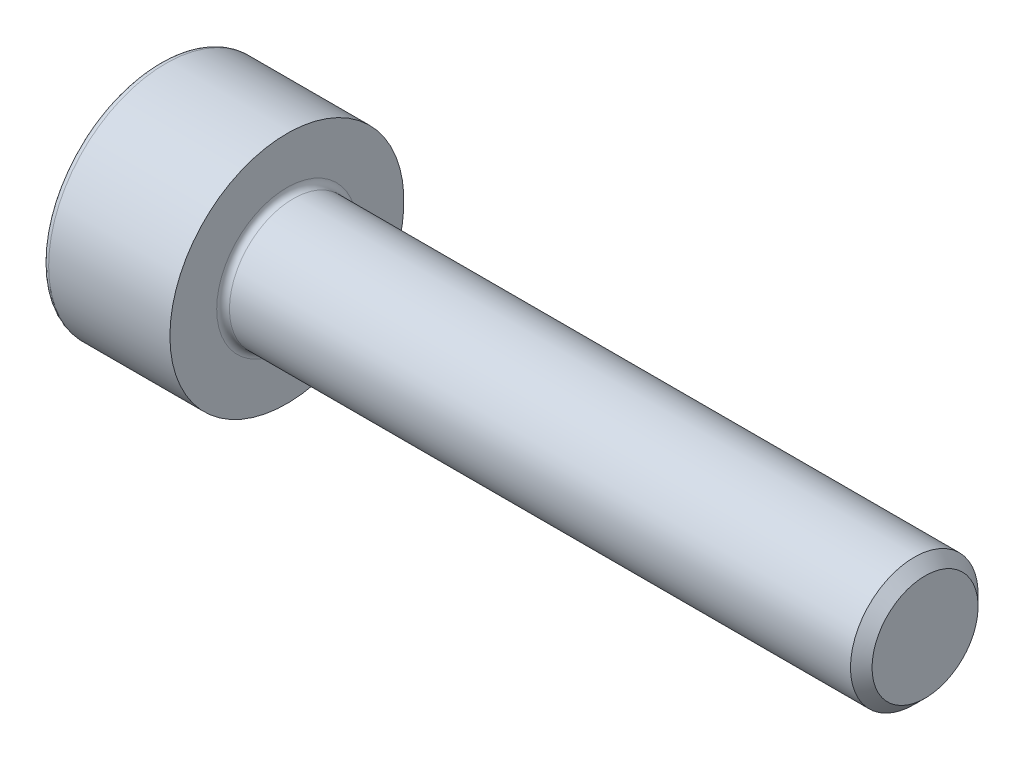
ISO-10303-21;
HEADER;
FILE_DESCRIPTION(('STEP AP214'),'2;1');
FILE_NAME('part.step','',(''),(''),'','','');
FILE_SCHEMA(('AUTOMOTIVE_DESIGN { 1 0 10303 214 1 1 1 1 }'));
ENDSEC;
DATA;
#1=APPLICATION_CONTEXT('core data for automotive mechanical design processes');
#2=APPLICATION_PROTOCOL_DEFINITION('international standard','automotive_design',2000,#1);
#3=PRODUCT_CONTEXT('',#1,'mechanical');
#4=PRODUCT('Part','Part','',(#3));
#5=PRODUCT_RELATED_PRODUCT_CATEGORY('part','',(#4));
#6=PRODUCT_DEFINITION_FORMATION('','',#4);
#7=PRODUCT_DEFINITION_CONTEXT('part definition',#1,'design');
#8=PRODUCT_DEFINITION('design','',#6,#7);
#9=PRODUCT_DEFINITION_SHAPE('','',#8);
#10=(LENGTH_UNIT() NAMED_UNIT(*) SI_UNIT(.MILLI.,.METRE.));
#11=(NAMED_UNIT(*) PLANE_ANGLE_UNIT() SI_UNIT($,.RADIAN.));
#12=(NAMED_UNIT(*) SI_UNIT($,.STERADIAN.) SOLID_ANGLE_UNIT());
#13=UNCERTAINTY_MEASURE_WITH_UNIT(LENGTH_MEASURE(1.E-05),#10,'distance_accuracy_value','');
#14=(GEOMETRIC_REPRESENTATION_CONTEXT(3) GLOBAL_UNCERTAINTY_ASSIGNED_CONTEXT((#13)) GLOBAL_UNIT_ASSIGNED_CONTEXT((#10,
#11,#12)) REPRESENTATION_CONTEXT('',''));
#15=CARTESIAN_POINT('',(0.,0.,0.));
#16=DIRECTION('',(0.,0.,1.));
#17=DIRECTION('',(1.,0.,0.));
#18=AXIS2_PLACEMENT_3D('',#15,#16,#17);
#19=CARTESIAN_POINT('',(15.,0.,0.));
#20=DIRECTION('',(-1.,0.,0.));
#21=DIRECTION('',(0.,0.,1.));
#22=AXIS2_PLACEMENT_3D('',#19,#20,#21);
#23=CONICAL_SURFACE('',#22,1.2464999999935,0.785398163397455);
#24=CARTESIAN_POINT('',(14.7464999999935,0.,0.));
#25=DIRECTION('',(-1.,0.,0.));
#26=DIRECTION('',(0.,0.,1.));
#27=AXIS2_PLACEMENT_3D('',#24,#25,#26);
#28=CIRCLE('',#27,1.5);
#29=CARTESIAN_POINT('',(14.7464999999935,0.,1.5));
#30=VERTEX_POINT('',#29);
#31=EDGE_CURVE('E11',#30,#30,#28,.T.);
#32=ORIENTED_EDGE('',*,*,#31,.F.);
#33=EDGE_LOOP('',(#32));
#34=FACE_BOUND('',#33,.T.);
#35=CARTESIAN_POINT('',(15.,0.,0.));
#36=DIRECTION('',(-1.,0.,0.));
#37=DIRECTION('',(0.,0.,1.));
#38=AXIS2_PLACEMENT_3D('',#35,#36,#37);
#39=CIRCLE('',#38,1.2464999999935);
#40=CARTESIAN_POINT('',(15.,0.,1.2464999999935));
#41=VERTEX_POINT('',#40);
#42=EDGE_CURVE('E133',#41,#41,#39,.T.);
#43=ORIENTED_EDGE('',*,*,#42,.T.);
#44=EDGE_LOOP('',(#43));
#45=FACE_BOUND('',#44,.T.);
#46=ADVANCED_FACE('F32',(#34,#45),#23,.T.);
#47=CARTESIAN_POINT('',(-3.,0.,0.));
#48=DIRECTION('',(-1.,0.,0.));
#49=DIRECTION('',(0.,0.,1.));
#50=AXIS2_PLACEMENT_3D('',#47,#48,#49);
#51=CYLINDRICAL_SURFACE('',#50,1.5);
#52=CARTESIAN_POINT('',(0.15,0.,0.));
#53=DIRECTION('',(-1.,0.,0.));
#54=DIRECTION('',(0.,0.,1.));
#55=AXIS2_PLACEMENT_3D('',#52,#53,#54);
#56=CIRCLE('',#55,1.5);
#57=CARTESIAN_POINT('',(0.15,0.,1.5));
#58=VERTEX_POINT('',#57);
#59=EDGE_CURVE('E39',#58,#58,#56,.T.);
#60=ORIENTED_EDGE('',*,*,#59,.F.);
#61=EDGE_LOOP('',(#60));
#62=FACE_BOUND('',#61,.T.);
#63=ORIENTED_EDGE('',*,*,#31,.T.);
#64=EDGE_LOOP('',(#63));
#65=FACE_BOUND('',#64,.T.);
#66=ADVANCED_FACE('F157',(#62,#65),#51,.T.);
#67=CARTESIAN_POINT('',(0.15,0.,0.));
#68=DIRECTION('',(-1.,0.,0.));
#69=DIRECTION('',(0.,0.,1.));
#70=AXIS2_PLACEMENT_3D('',#67,#68,#69);
#71=TOROIDAL_SURFACE('',#70,1.65,0.15);
#72=CARTESIAN_POINT('',(0.,0.,0.));
#73=DIRECTION('',(-1.,0.,0.));
#74=DIRECTION('',(0.,0.,1.));
#75=AXIS2_PLACEMENT_3D('',#72,#73,#74);
#76=CIRCLE('',#75,1.65);
#77=CARTESIAN_POINT('',(0.,0.,1.65));
#78=VERTEX_POINT('',#77);
#79=EDGE_CURVE('E150',#78,#78,#76,.T.);
#80=ORIENTED_EDGE('',*,*,#79,.F.);
#81=EDGE_LOOP('',(#80));
#82=FACE_BOUND('',#81,.T.);
#83=ORIENTED_EDGE('',*,*,#59,.T.);
#84=EDGE_LOOP('',(#83));
#85=FACE_BOUND('',#84,.T.);
#86=ADVANCED_FACE('F155',(#82,#85),#71,.F.);
#87=CARTESIAN_POINT('',(0.,1.65,0.));
#88=DIRECTION('',(-1.,0.,0.));
#89=DIRECTION('',(0.,0.,1.));
#90=AXIS2_PLACEMENT_3D('',#87,#88,#89);
#91=PLANE('',#90);
#92=CARTESIAN_POINT('',(0.,0.,0.));
#93=DIRECTION('',(-1.,0.,0.));
#94=DIRECTION('',(0.,0.,1.));
#95=AXIS2_PLACEMENT_3D('',#92,#93,#94);
#96=CIRCLE('',#95,2.75);
#97=CARTESIAN_POINT('',(0.,0.,2.75));
#98=VERTEX_POINT('',#97);
#99=EDGE_CURVE('E147',#98,#98,#96,.T.);
#100=ORIENTED_EDGE('',*,*,#99,.F.);
#101=EDGE_LOOP('',(#100));
#102=FACE_BOUND('',#101,.T.);
#103=ORIENTED_EDGE('',*,*,#79,.T.);
#104=EDGE_LOOP('',(#103));
#105=FACE_BOUND('',#104,.T.);
#106=ADVANCED_FACE('F188',(#102,#105),#91,.F.);
#107=CARTESIAN_POINT('',(-3.,0.,0.));
#108=DIRECTION('',(-1.,0.,0.));
#109=DIRECTION('',(0.,0.,1.));
#110=AXIS2_PLACEMENT_3D('',#107,#108,#109);
#111=CYLINDRICAL_SURFACE('',#110,2.75);
#112=CARTESIAN_POINT('',(-2.85,0.,0.));
#113=DIRECTION('',(-1.,0.,0.));
#114=DIRECTION('',(0.,0.,1.));
#115=AXIS2_PLACEMENT_3D('',#112,#113,#114);
#116=CIRCLE('',#115,2.75);
#117=CARTESIAN_POINT('',(-2.85,0.,2.75));
#118=VERTEX_POINT('',#117);
#119=EDGE_CURVE('E144',#118,#118,#116,.T.);
#120=ORIENTED_EDGE('',*,*,#119,.F.);
#121=EDGE_LOOP('',(#120));
#122=FACE_BOUND('',#121,.T.);
#123=ORIENTED_EDGE('',*,*,#99,.T.);
#124=EDGE_LOOP('',(#123));
#125=FACE_BOUND('',#124,.T.);
#126=ADVANCED_FACE('F184',(#122,#125),#111,.T.);
#127=CARTESIAN_POINT('',(-2.85,0.,0.));
#128=DIRECTION('',(-1.,0.,0.));
#129=DIRECTION('',(0.,0.,1.));
#130=AXIS2_PLACEMENT_3D('',#127,#128,#129);
#131=TOROIDAL_SURFACE('',#130,2.6,0.15);
#132=CARTESIAN_POINT('',(-3.,0.,0.));
#133=DIRECTION('',(-1.,0.,0.));
#134=DIRECTION('',(0.,0.,1.));
#135=AXIS2_PLACEMENT_3D('',#132,#133,#134);
#136=CIRCLE('',#135,2.6);
#137=CARTESIAN_POINT('',(-3.,0.,2.6));
#138=VERTEX_POINT('',#137);
#139=EDGE_CURVE('E141',#138,#138,#136,.T.);
#140=ORIENTED_EDGE('',*,*,#139,.F.);
#141=EDGE_LOOP('',(#140));
#142=FACE_BOUND('',#141,.T.);
#143=ORIENTED_EDGE('',*,*,#119,.T.);
#144=EDGE_LOOP('',(#143));
#145=FACE_BOUND('',#144,.T.);
#146=ADVANCED_FACE('F177',(#142,#145),#131,.T.);
#147=CARTESIAN_POINT('',(-3.,2.6,0.));
#148=DIRECTION('',(1.,0.,0.));
#149=DIRECTION('',(0.,0.,-1.));
#150=AXIS2_PLACEMENT_3D('',#147,#148,#149);
#151=PLANE('',#150);
#152=DIRECTION('',(0.,0.5,-0.866025403784438));
#153=VECTOR('',#152,1.);
#154=CARTESIAN_POINT('',(-3.,0.739008344562721,1.28));
#155=LINE('',#154,#153);
#156=CARTESIAN_POINT('',(-3.,0.739008344562721,1.28));
#157=VERTEX_POINT('',#156);
#158=CARTESIAN_POINT('',(-3.,1.47801668912544,0.));
#159=VERTEX_POINT('',#158);
#160=EDGE_CURVE('E120',#157,#159,#155,.T.);
#161=ORIENTED_EDGE('',*,*,#160,.F.);
#162=DIRECTION('',(0.,1.,0.));
#163=VECTOR('',#162,1.);
#164=CARTESIAN_POINT('',(-3.,-0.739008344562722,1.28));
#165=LINE('',#164,#163);
#166=CARTESIAN_POINT('',(-3.,-0.739008344562722,1.28));
#167=VERTEX_POINT('',#166);
#168=EDGE_CURVE('E46',#167,#157,#165,.T.);
#169=ORIENTED_EDGE('',*,*,#168,.F.);
#170=DIRECTION('',(0.,0.5,0.866025403784439));
#171=VECTOR('',#170,1.);
#172=CARTESIAN_POINT('',(-3.,-1.47801668912544,0.));
#173=LINE('',#172,#171);
#174=CARTESIAN_POINT('',(-3.,-1.47801668912544,0.));
#175=VERTEX_POINT('',#174);
#176=EDGE_CURVE('E129',#175,#167,#173,.T.);
#177=ORIENTED_EDGE('',*,*,#176,.F.);
#178=DIRECTION('',(0.,-0.5,0.866025403784439));
#179=VECTOR('',#178,1.);
#180=CARTESIAN_POINT('',(-3.,-0.739008344562721,-1.28));
#181=LINE('',#180,#179);
#182=CARTESIAN_POINT('',(-3.,-0.739008344562721,-1.28));
#183=VERTEX_POINT('',#182);
#184=EDGE_CURVE('E127',#183,#175,#181,.T.);
#185=ORIENTED_EDGE('',*,*,#184,.F.);
#186=DIRECTION('',(0.,-1.,0.));
#187=VECTOR('',#186,1.);
#188=CARTESIAN_POINT('',(-3.,0.739008344562722,-1.28));
#189=LINE('',#188,#187);
#190=CARTESIAN_POINT('',(-3.,0.739008344562722,-1.28));
#191=VERTEX_POINT('',#190);
#192=EDGE_CURVE('E94',#191,#183,#189,.T.);
#193=ORIENTED_EDGE('',*,*,#192,.F.);
#194=DIRECTION('',(0.,-0.5,-0.866025403784439));
#195=VECTOR('',#194,1.);
#196=CARTESIAN_POINT('',(-3.,1.47801668912544,0.));
#197=LINE('',#196,#195);
#198=EDGE_CURVE('E123',#159,#191,#197,.T.);
#199=ORIENTED_EDGE('',*,*,#198,.F.);
#200=EDGE_LOOP('',(#161,#169,#177,#185,#193,#199));
#201=FACE_BOUND('',#200,.T.);
#202=ORIENTED_EDGE('',*,*,#139,.T.);
#203=EDGE_LOOP('',(#202));
#204=FACE_BOUND('',#203,.T.);
#205=ADVANCED_FACE('F169',(#201,#204),#151,.F.);
#206=CARTESIAN_POINT('',(15.,1.2464999999935,0.));
#207=DIRECTION('',(-1.,0.,0.));
#208=DIRECTION('',(0.,0.,1.));
#209=AXIS2_PLACEMENT_3D('',#206,#207,#208);
#210=PLANE('',#209);
#211=ORIENTED_EDGE('',*,*,#42,.F.);
#212=EDGE_LOOP('',(#211));
#213=FACE_BOUND('',#212,.T.);
#214=ADVANCED_FACE('F166',(#213),#210,.F.);
#215=CARTESIAN_POINT('',(-1.7,-0.739008344562722,1.28));
#216=DIRECTION('',(0.,0.,1.));
#217=DIRECTION('',(1.,0.,0.));
#218=AXIS2_PLACEMENT_3D('',#215,#216,#217);
#219=PLANE('',#218);
#220=ORIENTED_EDGE('',*,*,#168,.T.);
#221=DIRECTION('',(-1.,0.,0.));
#222=VECTOR('',#221,1.);
#223=CARTESIAN_POINT('',(-1.7,0.739008344562721,1.28));
#224=LINE('',#223,#222);
#225=CARTESIAN_POINT('',(-1.7,0.739008344562721,1.28));
#226=VERTEX_POINT('',#225);
#227=EDGE_CURVE('E76',#226,#157,#224,.T.);
#228=ORIENTED_EDGE('',*,*,#227,.F.);
#229=DIRECTION('',(0.,1.,0.));
#230=VECTOR('',#229,1.);
#231=CARTESIAN_POINT('',(-1.7,-0.739008344562722,1.28));
#232=LINE('',#231,#230);
#233=CARTESIAN_POINT('',(-1.7,-0.739008344562722,1.28));
#234=VERTEX_POINT('',#233);
#235=EDGE_CURVE('E131',#234,#226,#232,.T.);
#236=ORIENTED_EDGE('',*,*,#235,.F.);
#237=DIRECTION('',(-1.,0.,0.));
#238=VECTOR('',#237,1.);
#239=CARTESIAN_POINT('',(-1.7,-0.739008344562722,1.28));
#240=LINE('',#239,#238);
#241=EDGE_CURVE('E54',#234,#167,#240,.T.);
#242=ORIENTED_EDGE('',*,*,#241,.T.);
#243=EDGE_LOOP('',(#220,#228,#236,#242));
#244=FACE_BOUND('',#243,.T.);
#245=ADVANCED_FACE('F168',(#244),#219,.F.);
#246=CARTESIAN_POINT('',(-1.7,-1.47801668912544,0.));
#247=DIRECTION('',(0.,-0.866025403784439,0.5));
#248=DIRECTION('',(0.,-0.5,-0.866025403784439));
#249=AXIS2_PLACEMENT_3D('',#246,#247,#248);
#250=PLANE('',#249);
#251=ORIENTED_EDGE('',*,*,#176,.T.);
#252=ORIENTED_EDGE('',*,*,#241,.F.);
#253=DIRECTION('',(0.,0.5,0.866025403784439));
#254=VECTOR('',#253,1.);
#255=CARTESIAN_POINT('',(-1.7,-1.47801668912544,0.));
#256=LINE('',#255,#254);
#257=CARTESIAN_POINT('',(-1.7,-1.47801668912544,0.));
#258=VERTEX_POINT('',#257);
#259=EDGE_CURVE('E106',#258,#234,#256,.T.);
#260=ORIENTED_EDGE('',*,*,#259,.F.);
#261=DIRECTION('',(-1.,0.,0.));
#262=VECTOR('',#261,1.);
#263=CARTESIAN_POINT('',(-1.7,-1.47801668912544,0.));
#264=LINE('',#263,#262);
#265=EDGE_CURVE('E98',#258,#175,#264,.T.);
#266=ORIENTED_EDGE('',*,*,#265,.T.);
#267=EDGE_LOOP('',(#251,#252,#260,#266));
#268=FACE_BOUND('',#267,.T.);
#269=ADVANCED_FACE('F175',(#268),#250,.F.);
#270=CARTESIAN_POINT('',(-1.7,-0.739008344562721,-1.28));
#271=DIRECTION('',(0.,-0.866025403784439,-0.5));
#272=DIRECTION('',(0.,0.5,-0.866025403784439));
#273=AXIS2_PLACEMENT_3D('',#270,#271,#272);
#274=PLANE('',#273);
#275=ORIENTED_EDGE('',*,*,#184,.T.);
#276=ORIENTED_EDGE('',*,*,#265,.F.);
#277=DIRECTION('',(0.,-0.5,0.866025403784439));
#278=VECTOR('',#277,1.);
#279=CARTESIAN_POINT('',(-1.7,-0.739008344562721,-1.28));
#280=LINE('',#279,#278);
#281=CARTESIAN_POINT('',(-1.7,-0.739008344562721,-1.28));
#282=VERTEX_POINT('',#281);
#283=EDGE_CURVE('E102',#282,#258,#280,.T.);
#284=ORIENTED_EDGE('',*,*,#283,.F.);
#285=DIRECTION('',(-1.,0.,0.));
#286=VECTOR('',#285,1.);
#287=CARTESIAN_POINT('',(-1.7,-0.739008344562721,-1.28));
#288=LINE('',#287,#286);
#289=EDGE_CURVE('E87',#282,#183,#288,.T.);
#290=ORIENTED_EDGE('',*,*,#289,.T.);
#291=EDGE_LOOP('',(#275,#276,#284,#290));
#292=FACE_BOUND('',#291,.T.);
#293=ADVANCED_FACE('F103',(#292),#274,.F.);
#294=CARTESIAN_POINT('',(-1.7,0.739008344562722,-1.28));
#295=DIRECTION('',(0.,0.,-1.));
#296=DIRECTION('',(0.,1.,0.));
#297=AXIS2_PLACEMENT_3D('',#294,#295,#296);
#298=PLANE('',#297);
#299=ORIENTED_EDGE('',*,*,#192,.T.);
#300=ORIENTED_EDGE('',*,*,#289,.F.);
#301=DIRECTION('',(0.,-1.,0.));
#302=VECTOR('',#301,1.);
#303=CARTESIAN_POINT('',(-1.7,0.739008344562722,-1.28));
#304=LINE('',#303,#302);
#305=CARTESIAN_POINT('',(-1.7,0.739008344562722,-1.28));
#306=VERTEX_POINT('',#305);
#307=EDGE_CURVE('E91',#306,#282,#304,.T.);
#308=ORIENTED_EDGE('',*,*,#307,.F.);
#309=DIRECTION('',(-1.,0.,0.));
#310=VECTOR('',#309,1.);
#311=CARTESIAN_POINT('',(-1.7,0.739008344562722,-1.28));
#312=LINE('',#311,#310);
#313=EDGE_CURVE('E99',#306,#191,#312,.T.);
#314=ORIENTED_EDGE('',*,*,#313,.T.);
#315=EDGE_LOOP('',(#299,#300,#308,#314));
#316=FACE_BOUND('',#315,.T.);
#317=ADVANCED_FACE('F89',(#316),#298,.F.);
#318=CARTESIAN_POINT('',(-1.7,1.47801668912544,0.));
#319=DIRECTION('',(0.,0.866025403784439,-0.5));
#320=DIRECTION('',(0.,0.5,0.866025403784439));
#321=AXIS2_PLACEMENT_3D('',#318,#319,#320);
#322=PLANE('',#321);
#323=ORIENTED_EDGE('',*,*,#198,.T.);
#324=ORIENTED_EDGE('',*,*,#313,.F.);
#325=DIRECTION('',(0.,-0.5,-0.866025403784439));
#326=VECTOR('',#325,1.);
#327=CARTESIAN_POINT('',(-1.7,1.47801668912544,0.));
#328=LINE('',#327,#326);
#329=CARTESIAN_POINT('',(-1.7,1.47801668912544,0.));
#330=VERTEX_POINT('',#329);
#331=EDGE_CURVE('E112',#330,#306,#328,.T.);
#332=ORIENTED_EDGE('',*,*,#331,.F.);
#333=DIRECTION('',(-1.,0.,0.));
#334=VECTOR('',#333,1.);
#335=CARTESIAN_POINT('',(-1.7,1.47801668912544,0.));
#336=LINE('',#335,#334);
#337=EDGE_CURVE('E136',#330,#159,#336,.T.);
#338=ORIENTED_EDGE('',*,*,#337,.T.);
#339=EDGE_LOOP('',(#323,#324,#332,#338));
#340=FACE_BOUND('',#339,.T.);
#341=ADVANCED_FACE('F250',(#340),#322,.F.);
#342=CARTESIAN_POINT('',(-1.7,0.739008344562721,1.28));
#343=DIRECTION('',(0.,0.866025403784439,0.5));
#344=DIRECTION('',(0.,-0.5,0.866025403784439));
#345=AXIS2_PLACEMENT_3D('',#342,#343,#344);
#346=PLANE('',#345);
#347=ORIENTED_EDGE('',*,*,#160,.T.);
#348=ORIENTED_EDGE('',*,*,#337,.F.);
#349=DIRECTION('',(0.,0.5,-0.866025403784438));
#350=VECTOR('',#349,1.);
#351=CARTESIAN_POINT('',(-1.7,0.739008344562721,1.28));
#352=LINE('',#351,#350);
#353=EDGE_CURVE('E114',#226,#330,#352,.T.);
#354=ORIENTED_EDGE('',*,*,#353,.F.);
#355=ORIENTED_EDGE('',*,*,#227,.T.);
#356=EDGE_LOOP('',(#347,#348,#354,#355));
#357=FACE_BOUND('',#356,.T.);
#358=ADVANCED_FACE('F259',(#357),#346,.F.);
#359=CARTESIAN_POINT('',(-1.7,0.,0.));
#360=DIRECTION('',(-1.,0.,0.));
#361=DIRECTION('',(0.,0.,1.));
#362=AXIS2_PLACEMENT_3D('',#359,#360,#361);
#363=PLANE('',#362);
#364=ORIENTED_EDGE('',*,*,#235,.T.);
#365=ORIENTED_EDGE('',*,*,#353,.T.);
#366=ORIENTED_EDGE('',*,*,#331,.T.);
#367=ORIENTED_EDGE('',*,*,#307,.T.);
#368=ORIENTED_EDGE('',*,*,#283,.T.);
#369=ORIENTED_EDGE('',*,*,#259,.T.);
#370=EDGE_LOOP('',(#364,#365,#366,#367,#368,#369));
#371=FACE_BOUND('',#370,.T.);
#372=ADVANCED_FACE('F109',(#371),#363,.T.);
#373=CLOSED_SHELL('',(#46,#66,#86,#106,#126,#146,#205,#214,#245,#269,#293,#317,#341,#358,#372));
#374=MANIFOLD_SOLID_BREP('B2',#373);
#375=ADVANCED_BREP_SHAPE_REPRESENTATION('',(#18,#374),#14);
#376=SHAPE_DEFINITION_REPRESENTATION(#9,#375);
ENDSEC;
END-ISO-10303-21;
